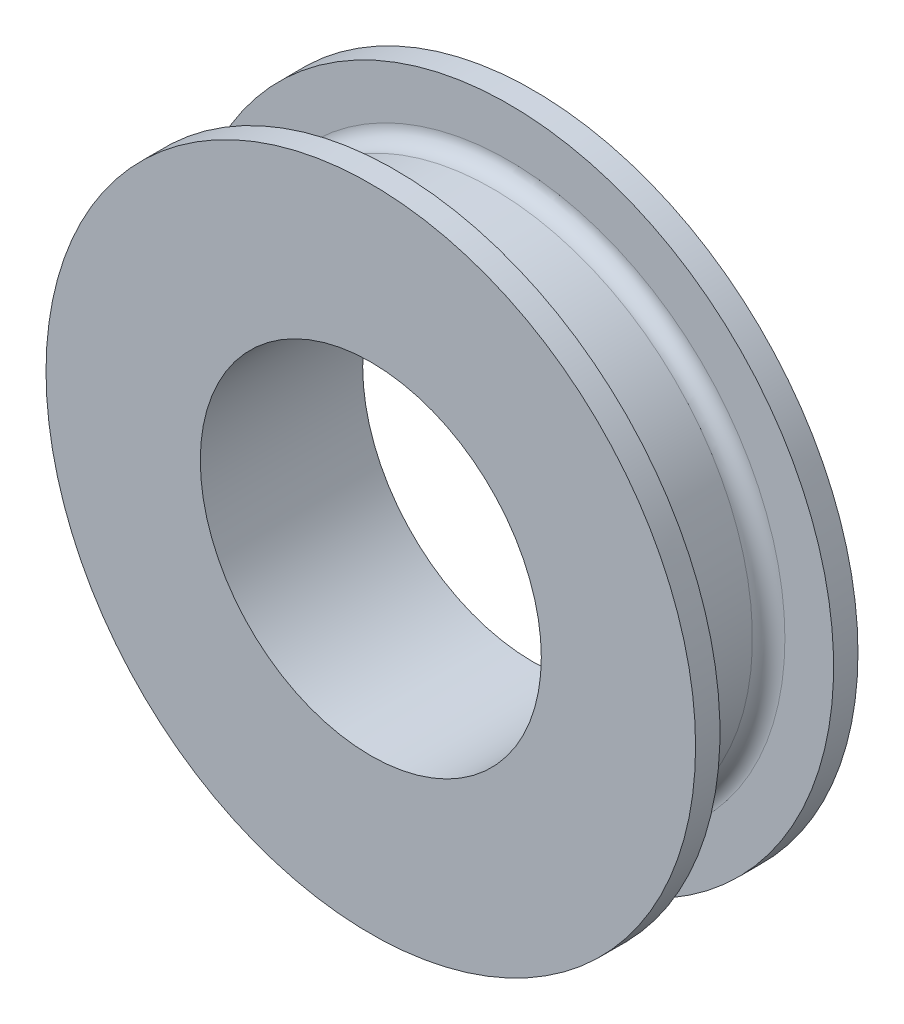
ISO-10303-21;
HEADER;
FILE_DESCRIPTION(('STEP AP214'),'2;1');
FILE_NAME('part.step','',(''),(''),'','','');
FILE_SCHEMA(('AUTOMOTIVE_DESIGN { 1 0 10303 214 1 1 1 1 }'));
ENDSEC;
DATA;
#1=APPLICATION_CONTEXT('core data for automotive mechanical design processes');
#2=APPLICATION_PROTOCOL_DEFINITION('international standard','automotive_design',2000,#1);
#3=PRODUCT_CONTEXT('',#1,'mechanical');
#4=PRODUCT('Part','Part','',(#3));
#5=PRODUCT_RELATED_PRODUCT_CATEGORY('part','',(#4));
#6=PRODUCT_DEFINITION_FORMATION('','',#4);
#7=PRODUCT_DEFINITION_CONTEXT('part definition',#1,'design');
#8=PRODUCT_DEFINITION('design','',#6,#7);
#9=PRODUCT_DEFINITION_SHAPE('','',#8);
#10=(LENGTH_UNIT() NAMED_UNIT(*) SI_UNIT(.MILLI.,.METRE.));
#11=(NAMED_UNIT(*) PLANE_ANGLE_UNIT() SI_UNIT($,.RADIAN.));
#12=(NAMED_UNIT(*) SI_UNIT($,.STERADIAN.) SOLID_ANGLE_UNIT());
#13=UNCERTAINTY_MEASURE_WITH_UNIT(LENGTH_MEASURE(1.E-05),#10,'distance_accuracy_value','');
#14=(GEOMETRIC_REPRESENTATION_CONTEXT(3) GLOBAL_UNCERTAINTY_ASSIGNED_CONTEXT((#13)) GLOBAL_UNIT_ASSIGNED_CONTEXT((#10,
#11,#12)) REPRESENTATION_CONTEXT('',''));
#15=CARTESIAN_POINT('',(0.,0.,0.));
#16=DIRECTION('',(0.,0.,1.));
#17=DIRECTION('',(1.,0.,0.));
#18=AXIS2_PLACEMENT_3D('',#15,#16,#17);
#19=CARTESIAN_POINT('',(0.,0.,10.));
#20=DIRECTION('',(0.,0.,-1.));
#21=DIRECTION('',(-1.,0.,0.));
#22=AXIS2_PLACEMENT_3D('',#19,#20,#21);
#23=CYLINDRICAL_SURFACE('',#22,40.);
#24=CARTESIAN_POINT('',(0.,0.,7.));
#25=DIRECTION('',(0.,0.,-1.));
#26=DIRECTION('',(-1.,0.,0.));
#27=AXIS2_PLACEMENT_3D('',#24,#25,#26);
#28=CIRCLE('',#27,40.);
#29=CARTESIAN_POINT('',(-40.,0.,7.));
#30=VERTEX_POINT('',#29);
#31=EDGE_CURVE('E52',#30,#30,#28,.T.);
#32=ORIENTED_EDGE('',*,*,#31,.F.);
#33=EDGE_LOOP('',(#32));
#34=FACE_BOUND('',#33,.T.);
#35=CARTESIAN_POINT('',(0.,0.,10.));
#36=DIRECTION('',(0.,0.,1.));
#37=DIRECTION('',(1.,0.,0.));
#38=AXIS2_PLACEMENT_3D('',#35,#36,#37);
#39=CIRCLE('',#38,40.);
#40=CARTESIAN_POINT('',(40.,0.,10.));
#41=VERTEX_POINT('',#40);
#42=EDGE_CURVE('E10',#41,#41,#39,.T.);
#43=ORIENTED_EDGE('',*,*,#42,.F.);
#44=EDGE_LOOP('',(#43));
#45=FACE_BOUND('',#44,.T.);
#46=ADVANCED_FACE('F35',(#34,#45),#23,.T.);
#47=CARTESIAN_POINT('',(0.,0.,10.));
#48=DIRECTION('',(0.,0.,-1.));
#49=DIRECTION('',(-1.,0.,0.));
#50=AXIS2_PLACEMENT_3D('',#47,#48,#49);
#51=CYLINDRICAL_SURFACE('',#50,21.);
#52=CARTESIAN_POINT('',(0.,0.,10.));
#53=DIRECTION('',(0.,0.,1.));
#54=DIRECTION('',(1.,0.,0.));
#55=AXIS2_PLACEMENT_3D('',#52,#53,#54);
#56=CIRCLE('',#55,21.);
#57=CARTESIAN_POINT('',(21.,0.,10.));
#58=VERTEX_POINT('',#57);
#59=EDGE_CURVE('E43',#58,#58,#56,.T.);
#60=ORIENTED_EDGE('',*,*,#59,.T.);
#61=EDGE_LOOP('',(#60));
#62=FACE_BOUND('',#61,.T.);
#63=CARTESIAN_POINT('',(0.,0.,-10.));
#64=DIRECTION('',(0.,0.,1.));
#65=DIRECTION('',(1.,0.,0.));
#66=AXIS2_PLACEMENT_3D('',#63,#64,#65);
#67=CIRCLE('',#66,21.);
#68=CARTESIAN_POINT('',(21.,0.,-10.));
#69=VERTEX_POINT('',#68);
#70=EDGE_CURVE('E50',#69,#69,#67,.T.);
#71=ORIENTED_EDGE('',*,*,#70,.F.);
#72=EDGE_LOOP('',(#71));
#73=FACE_BOUND('',#72,.T.);
#74=ADVANCED_FACE('F37',(#62,#73),#51,.F.);
#75=CARTESIAN_POINT('',(0.,0.,-7.));
#76=DIRECTION('',(0.,0.,-1.));
#77=DIRECTION('',(-1.,0.,0.));
#78=AXIS2_PLACEMENT_3D('',#75,#76,#77);
#79=CIRCLE('',#78,40.);
#80=CARTESIAN_POINT('',(-40.,0.,-7.));
#81=VERTEX_POINT('',#80);
#82=EDGE_CURVE('E72',#81,#81,#79,.T.);
#83=ORIENTED_EDGE('',*,*,#82,.T.);
#84=EDGE_LOOP('',(#83));
#85=FACE_BOUND('',#84,.T.);
#86=CARTESIAN_POINT('',(0.,0.,-10.));
#87=DIRECTION('',(0.,0.,1.));
#88=DIRECTION('',(1.,0.,0.));
#89=AXIS2_PLACEMENT_3D('',#86,#87,#88);
#90=CIRCLE('',#89,40.);
#91=CARTESIAN_POINT('',(40.,0.,-10.));
#92=VERTEX_POINT('',#91);
#93=EDGE_CURVE('E39',#92,#92,#90,.T.);
#94=ORIENTED_EDGE('',*,*,#93,.T.);
#95=EDGE_LOOP('',(#94));
#96=FACE_BOUND('',#95,.T.);
#97=ADVANCED_FACE('F76',(#85,#96),#23,.T.);
#98=CARTESIAN_POINT('',(0.,0.,10.));
#99=DIRECTION('',(0.,0.,1.));
#100=DIRECTION('',(1.,0.,0.));
#101=AXIS2_PLACEMENT_3D('',#98,#99,#100);
#102=PLANE('',#101);
#103=ORIENTED_EDGE('',*,*,#59,.F.);
#104=EDGE_LOOP('',(#103));
#105=FACE_BOUND('',#104,.T.);
#106=ORIENTED_EDGE('',*,*,#42,.T.);
#107=EDGE_LOOP('',(#106));
#108=FACE_BOUND('',#107,.T.);
#109=ADVANCED_FACE('F110',(#105,#108),#102,.T.);
#110=CARTESIAN_POINT('',(0.,0.,-10.));
#111=DIRECTION('',(0.,0.,1.));
#112=DIRECTION('',(1.,0.,0.));
#113=AXIS2_PLACEMENT_3D('',#110,#111,#112);
#114=PLANE('',#113);
#115=ORIENTED_EDGE('',*,*,#70,.T.);
#116=EDGE_LOOP('',(#115));
#117=FACE_BOUND('',#116,.T.);
#118=ORIENTED_EDGE('',*,*,#93,.F.);
#119=EDGE_LOOP('',(#118));
#120=FACE_BOUND('',#119,.T.);
#121=ADVANCED_FACE('F105',(#117,#120),#114,.F.);
#122=CARTESIAN_POINT('',(0.,40.,7.));
#123=DIRECTION('',(0.,0.,1.));
#124=DIRECTION('',(1.,0.,0.));
#125=AXIS2_PLACEMENT_3D('',#122,#123,#124);
#126=PLANE('',#125);
#127=CARTESIAN_POINT('',(0.,0.,7.));
#128=DIRECTION('',(0.,0.,-1.));
#129=DIRECTION('',(-1.,0.,0.));
#130=AXIS2_PLACEMENT_3D('',#127,#128,#129);
#131=CIRCLE('',#130,34.);
#132=CARTESIAN_POINT('',(-34.,0.,7.));
#133=VERTEX_POINT('',#132);
#134=EDGE_CURVE('E57',#133,#133,#131,.T.);
#135=ORIENTED_EDGE('',*,*,#134,.F.);
#136=EDGE_LOOP('',(#135));
#137=FACE_BOUND('',#136,.T.);
#138=ORIENTED_EDGE('',*,*,#31,.T.);
#139=EDGE_LOOP('',(#138));
#140=FACE_BOUND('',#139,.T.);
#141=ADVANCED_FACE('F100',(#137,#140),#126,.F.);
#142=CARTESIAN_POINT('',(0.,0.,5.));
#143=DIRECTION('',(0.,0.,-1.));
#144=DIRECTION('',(-1.,0.,0.));
#145=AXIS2_PLACEMENT_3D('',#142,#143,#144);
#146=TOROIDAL_SURFACE('',#145,34.,2.);
#147=CARTESIAN_POINT('',(0.,0.,5.));
#148=DIRECTION('',(0.,0.,-1.));
#149=DIRECTION('',(-1.,0.,0.));
#150=AXIS2_PLACEMENT_3D('',#147,#148,#149);
#151=CIRCLE('',#150,32.);
#152=CARTESIAN_POINT('',(-32.,0.,5.));
#153=VERTEX_POINT('',#152);
#154=EDGE_CURVE('E61',#153,#153,#151,.T.);
#155=ORIENTED_EDGE('',*,*,#154,.F.);
#156=EDGE_LOOP('',(#155));
#157=FACE_BOUND('',#156,.T.);
#158=ORIENTED_EDGE('',*,*,#134,.T.);
#159=EDGE_LOOP('',(#158));
#160=FACE_BOUND('',#159,.T.);
#161=ADVANCED_FACE('F94',(#157,#160),#146,.F.);
#162=CARTESIAN_POINT('',(0.,0.,0.));
#163=DIRECTION('',(0.,0.,-1.));
#164=DIRECTION('',(-1.,0.,0.));
#165=AXIS2_PLACEMENT_3D('',#162,#163,#164);
#166=CYLINDRICAL_SURFACE('',#165,32.);
#167=CARTESIAN_POINT('',(0.,0.,-5.));
#168=DIRECTION('',(0.,0.,-1.));
#169=DIRECTION('',(-1.,0.,0.));
#170=AXIS2_PLACEMENT_3D('',#167,#168,#169);
#171=CIRCLE('',#170,32.);
#172=CARTESIAN_POINT('',(-32.,0.,-5.));
#173=VERTEX_POINT('',#172);
#174=EDGE_CURVE('E66',#173,#173,#171,.T.);
#175=ORIENTED_EDGE('',*,*,#174,.F.);
#176=EDGE_LOOP('',(#175));
#177=FACE_BOUND('',#176,.T.);
#178=ORIENTED_EDGE('',*,*,#154,.T.);
#179=EDGE_LOOP('',(#178));
#180=FACE_BOUND('',#179,.T.);
#181=ADVANCED_FACE('F88',(#177,#180),#166,.T.);
#182=CARTESIAN_POINT('',(0.,0.,-5.));
#183=DIRECTION('',(0.,0.,-1.));
#184=DIRECTION('',(-1.,0.,0.));
#185=AXIS2_PLACEMENT_3D('',#182,#183,#184);
#186=TOROIDAL_SURFACE('',#185,34.,2.);
#187=CARTESIAN_POINT('',(0.,0.,-7.));
#188=DIRECTION('',(0.,0.,-1.));
#189=DIRECTION('',(-1.,0.,0.));
#190=AXIS2_PLACEMENT_3D('',#187,#188,#189);
#191=CIRCLE('',#190,34.);
#192=CARTESIAN_POINT('',(-34.,0.,-7.));
#193=VERTEX_POINT('',#192);
#194=EDGE_CURVE('E69',#193,#193,#191,.T.);
#195=ORIENTED_EDGE('',*,*,#194,.F.);
#196=EDGE_LOOP('',(#195));
#197=FACE_BOUND('',#196,.T.);
#198=ORIENTED_EDGE('',*,*,#174,.T.);
#199=EDGE_LOOP('',(#198));
#200=FACE_BOUND('',#199,.T.);
#201=ADVANCED_FACE('F82',(#197,#200),#186,.F.);
#202=CARTESIAN_POINT('',(0.,34.,-7.));
#203=DIRECTION('',(0.,0.,-1.));
#204=DIRECTION('',(-1.,0.,0.));
#205=AXIS2_PLACEMENT_3D('',#202,#203,#204);
#206=PLANE('',#205);
#207=ORIENTED_EDGE('',*,*,#82,.F.);
#208=EDGE_LOOP('',(#207));
#209=FACE_BOUND('',#208,.T.);
#210=ORIENTED_EDGE('',*,*,#194,.T.);
#211=EDGE_LOOP('',(#210));
#212=FACE_BOUND('',#211,.T.);
#213=ADVANCED_FACE('F79',(#209,#212),#206,.F.);
#214=CLOSED_SHELL('',(#46,#74,#97,#109,#121,#141,#161,#181,#201,#213));
#215=MANIFOLD_SOLID_BREP('B2',#214);
#216=ADVANCED_BREP_SHAPE_REPRESENTATION('',(#18,#215),#14);
#217=SHAPE_DEFINITION_REPRESENTATION(#9,#216);
ENDSEC;
END-ISO-10303-21;
